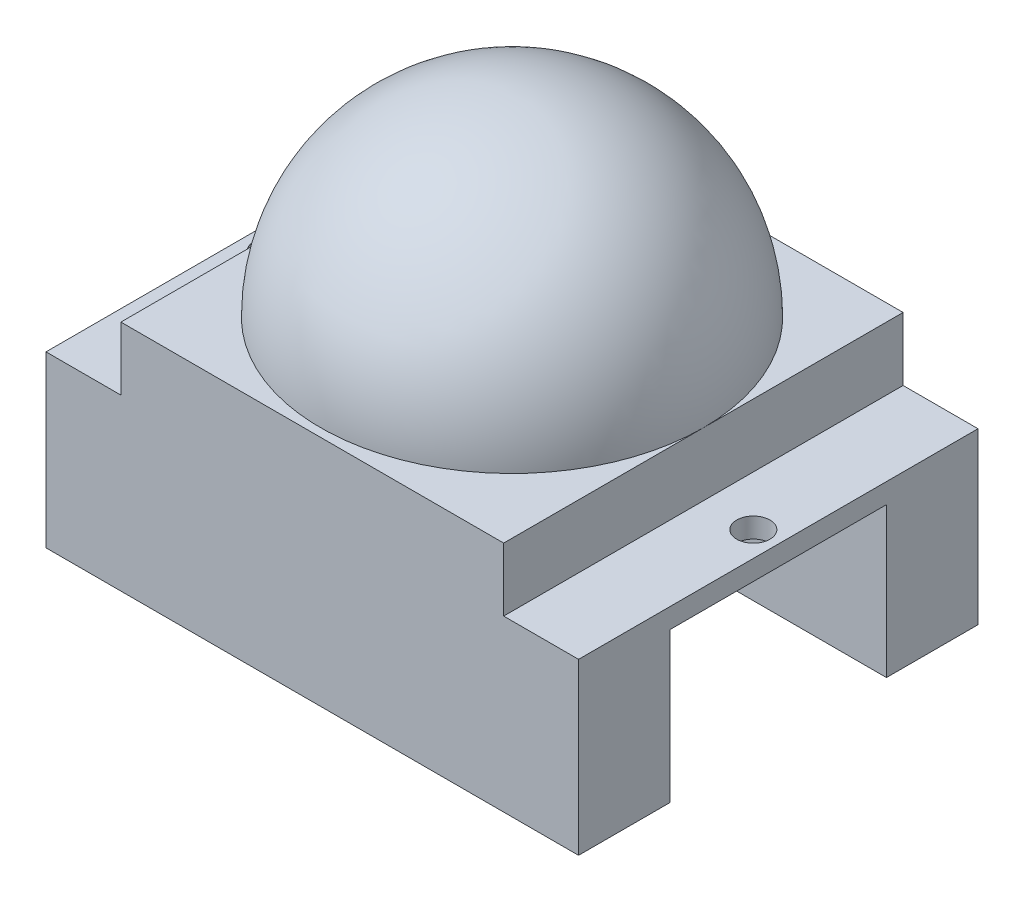
ISO-10303-21;
HEADER;
FILE_DESCRIPTION(('STEP AP214'),'2;1');
FILE_NAME('part.step','',(''),(''),'','','');
FILE_SCHEMA(('AUTOMOTIVE_DESIGN { 1 0 10303 214 1 1 1 1 }'));
ENDSEC;
DATA;
#1=APPLICATION_CONTEXT('core data for automotive mechanical design processes');
#2=APPLICATION_PROTOCOL_DEFINITION('international standard','automotive_design',2000,#1);
#3=PRODUCT_CONTEXT('',#1,'mechanical');
#4=PRODUCT('Part','Part','',(#3));
#5=PRODUCT_RELATED_PRODUCT_CATEGORY('part','',(#4));
#6=PRODUCT_DEFINITION_FORMATION('','',#4);
#7=PRODUCT_DEFINITION_CONTEXT('part definition',#1,'design');
#8=PRODUCT_DEFINITION('design','',#6,#7);
#9=PRODUCT_DEFINITION_SHAPE('','',#8);
#10=(LENGTH_UNIT() NAMED_UNIT(*) SI_UNIT(.MILLI.,.METRE.));
#11=(NAMED_UNIT(*) PLANE_ANGLE_UNIT() SI_UNIT($,.RADIAN.));
#12=(NAMED_UNIT(*) SI_UNIT($,.STERADIAN.) SOLID_ANGLE_UNIT());
#13=UNCERTAINTY_MEASURE_WITH_UNIT(LENGTH_MEASURE(1.E-05),#10,'distance_accuracy_value','');
#14=(GEOMETRIC_REPRESENTATION_CONTEXT(3) GLOBAL_UNCERTAINTY_ASSIGNED_CONTEXT((#13)) GLOBAL_UNIT_ASSIGNED_CONTEXT((#10,
#11,#12)) REPRESENTATION_CONTEXT('',''));
#15=CARTESIAN_POINT('',(0.,0.,0.));
#16=DIRECTION('',(0.,0.,1.));
#17=DIRECTION('',(1.,0.,0.));
#18=AXIS2_PLACEMENT_3D('',#15,#16,#17);
#19=CARTESIAN_POINT('',(0.,5.,0.));
#20=DIRECTION('',(0.,1.,0.));
#21=DIRECTION('',(0.,0.,1.));
#22=AXIS2_PLACEMENT_3D('',#19,#20,#21);
#23=PLANE('',#22);
#24=CARTESIAN_POINT('',(0.,5.,0.));
#25=DIRECTION('',(0.,1.,0.));
#26=DIRECTION('',(0.,0.,1.));
#27=AXIS2_PLACEMENT_3D('',#24,#25,#26);
#28=CIRCLE('',#27,11.5);
#29=CARTESIAN_POINT('',(11.5,5.,0.));
#30=VERTEX_POINT('',#29);
#31=CARTESIAN_POINT('',(-11.5,5.,0.));
#32=VERTEX_POINT('',#31);
#33=EDGE_CURVE('E11',#30,#32,#28,.T.);
#34=ORIENTED_EDGE('',*,*,#33,.F.);
#35=DIRECTION('',(0.,0.,-1.));
#36=VECTOR('',#35,1.);
#37=CARTESIAN_POINT('',(11.5,5.,12.));
#38=LINE('',#37,#36);
#39=CARTESIAN_POINT('',(11.5,5.,-12.));
#40=VERTEX_POINT('',#39);
#41=EDGE_CURVE('E196',#30,#40,#38,.T.);
#42=ORIENTED_EDGE('',*,*,#41,.T.);
#43=DIRECTION('',(-1.,0.,0.));
#44=VECTOR('',#43,1.);
#45=CARTESIAN_POINT('',(11.5,5.,-12.));
#46=LINE('',#45,#44);
#47=CARTESIAN_POINT('',(-11.5,5.,-12.));
#48=VERTEX_POINT('',#47);
#49=EDGE_CURVE('E187',#40,#48,#46,.T.);
#50=ORIENTED_EDGE('',*,*,#49,.T.);
#51=DIRECTION('',(0.,0.,1.));
#52=VECTOR('',#51,1.);
#53=CARTESIAN_POINT('',(-11.5,5.,-12.));
#54=LINE('',#53,#52);
#55=EDGE_CURVE('E191',#48,#32,#54,.T.);
#56=ORIENTED_EDGE('',*,*,#55,.T.);
#57=EDGE_LOOP('',(#34,#42,#50,#56));
#58=FACE_BOUND('',#57,.T.);
#59=ADVANCED_FACE('F38',(#58),#23,.T.);
#60=CARTESIAN_POINT('',(0.,1.2,0.));
#61=DIRECTION('',(0.,-1.,0.));
#62=DIRECTION('',(0.,0.,-1.));
#63=AXIS2_PLACEMENT_3D('',#60,#61,#62);
#64=PLANE('',#63);
#65=CARTESIAN_POINT('',(-14.5,1.2,0.));
#66=DIRECTION('',(0.,-1.,0.));
#67=DIRECTION('',(0.,0.,-1.));
#68=AXIS2_PLACEMENT_3D('',#65,#66,#67);
#69=CIRCLE('',#68,1.);
#70=CARTESIAN_POINT('',(-14.5,1.2,-1.));
#71=VERTEX_POINT('',#70);
#72=EDGE_CURVE('E461',#71,#71,#69,.F.);
#73=ORIENTED_EDGE('',*,*,#72,.F.);
#74=EDGE_LOOP('',(#73));
#75=FACE_BOUND('',#74,.T.);
#76=DIRECTION('',(0.,0.,1.));
#77=VECTOR('',#76,1.);
#78=CARTESIAN_POINT('',(-11.5,1.2,0.));
#79=LINE('',#78,#77);
#80=CARTESIAN_POINT('',(-11.5,1.2,-12.));
#81=VERTEX_POINT('',#80);
#82=CARTESIAN_POINT('',(-11.5,1.2,12.));
#83=VERTEX_POINT('',#82);
#84=EDGE_CURVE('E214',#81,#83,#79,.T.);
#85=ORIENTED_EDGE('',*,*,#84,.F.);
#86=DIRECTION('',(1.,0.,0.));
#87=VECTOR('',#86,1.);
#88=CARTESIAN_POINT('',(-16.,1.2,-12.));
#89=LINE('',#88,#87);
#90=CARTESIAN_POINT('',(-16.,1.2,-12.));
#91=VERTEX_POINT('',#90);
#92=EDGE_CURVE('E225',#91,#81,#89,.T.);
#93=ORIENTED_EDGE('',*,*,#92,.F.);
#94=DIRECTION('',(0.,0.,1.));
#95=VECTOR('',#94,1.);
#96=CARTESIAN_POINT('',(-16.,1.2,-12.));
#97=LINE('',#96,#95);
#98=CARTESIAN_POINT('',(-16.,1.2,12.));
#99=VERTEX_POINT('',#98);
#100=EDGE_CURVE('E228',#91,#99,#97,.T.);
#101=ORIENTED_EDGE('',*,*,#100,.T.);
#102=DIRECTION('',(1.,0.,0.));
#103=VECTOR('',#102,1.);
#104=CARTESIAN_POINT('',(-16.,1.2,12.));
#105=LINE('',#104,#103);
#106=EDGE_CURVE('E218',#99,#83,#105,.T.);
#107=ORIENTED_EDGE('',*,*,#106,.T.);
#108=EDGE_LOOP('',(#85,#93,#101,#107));
#109=FACE_BOUND('',#108,.T.);
#110=ADVANCED_FACE('F248',(#75,#109),#64,.F.);
#111=CARTESIAN_POINT('',(14.5,1.2,0.));
#112=DIRECTION('',(0.,-1.,0.));
#113=DIRECTION('',(0.,0.,-1.));
#114=AXIS2_PLACEMENT_3D('',#111,#112,#113);
#115=CIRCLE('',#114,1.);
#116=CARTESIAN_POINT('',(14.5,1.2,-1.));
#117=VERTEX_POINT('',#116);
#118=EDGE_CURVE('E161',#117,#117,#115,.F.);
#119=ORIENTED_EDGE('',*,*,#118,.F.);
#120=EDGE_LOOP('',(#119));
#121=FACE_BOUND('',#120,.T.);
#122=DIRECTION('',(0.,0.,-1.));
#123=VECTOR('',#122,1.);
#124=CARTESIAN_POINT('',(11.5,1.2,0.));
#125=LINE('',#124,#123);
#126=CARTESIAN_POINT('',(11.5,1.2,12.));
#127=VERTEX_POINT('',#126);
#128=CARTESIAN_POINT('',(11.5,1.2,-12.));
#129=VERTEX_POINT('',#128);
#130=EDGE_CURVE('E211',#127,#129,#125,.T.);
#131=ORIENTED_EDGE('',*,*,#130,.F.);
#132=CARTESIAN_POINT('',(16.,1.2,12.));
#133=VERTEX_POINT('',#132);
#134=EDGE_CURVE('E221',#127,#133,#105,.T.);
#135=ORIENTED_EDGE('',*,*,#134,.T.);
#136=DIRECTION('',(0.,0.,1.));
#137=VECTOR('',#136,1.);
#138=CARTESIAN_POINT('',(16.,1.2,-12.));
#139=LINE('',#138,#137);
#140=CARTESIAN_POINT('',(16.,1.2,-12.));
#141=VERTEX_POINT('',#140);
#142=EDGE_CURVE('E220',#141,#133,#139,.T.);
#143=ORIENTED_EDGE('',*,*,#142,.F.);
#144=EDGE_CURVE('E224',#129,#141,#89,.T.);
#145=ORIENTED_EDGE('',*,*,#144,.F.);
#146=EDGE_LOOP('',(#131,#135,#143,#145));
#147=FACE_BOUND('',#146,.T.);
#148=ADVANCED_FACE('F266',(#121,#147),#64,.F.);
#149=CARTESIAN_POINT('',(-16.,1.2,12.));
#150=DIRECTION('',(0.,0.,-1.));
#151=DIRECTION('',(-1.,0.,0.));
#152=AXIS2_PLACEMENT_3D('',#149,#150,#151);
#153=PLANE('',#152);
#154=DIRECTION('',(0.,-1.,0.));
#155=VECTOR('',#154,1.);
#156=CARTESIAN_POINT('',(-16.,1.2,12.));
#157=LINE('',#156,#155);
#158=CARTESIAN_POINT('',(-16.,-9.,12.));
#159=VERTEX_POINT('',#158);
#160=EDGE_CURVE('E230',#99,#159,#157,.T.);
#161=ORIENTED_EDGE('',*,*,#160,.T.);
#162=DIRECTION('',(1.,0.,0.));
#163=VECTOR('',#162,1.);
#164=CARTESIAN_POINT('',(0.,-9.,12.));
#165=LINE('',#164,#163);
#166=CARTESIAN_POINT('',(16.,-9.,12.));
#167=VERTEX_POINT('',#166);
#168=EDGE_CURVE('E156',#159,#167,#165,.T.);
#169=ORIENTED_EDGE('',*,*,#168,.T.);
#170=DIRECTION('',(0.,-1.,0.));
#171=VECTOR('',#170,1.);
#172=CARTESIAN_POINT('',(16.,1.2,12.));
#173=LINE('',#172,#171);
#174=EDGE_CURVE('E46',#133,#167,#173,.T.);
#175=ORIENTED_EDGE('',*,*,#174,.F.);
#176=ORIENTED_EDGE('',*,*,#134,.F.);
#177=DIRECTION('',(0.,-1.,0.));
#178=VECTOR('',#177,1.);
#179=CARTESIAN_POINT('',(11.5,5.,12.));
#180=LINE('',#179,#178);
#181=CARTESIAN_POINT('',(11.5,5.,12.));
#182=VERTEX_POINT('',#181);
#183=EDGE_CURVE('E202',#182,#127,#180,.T.);
#184=ORIENTED_EDGE('',*,*,#183,.F.);
#185=DIRECTION('',(1.,0.,0.));
#186=VECTOR('',#185,1.);
#187=CARTESIAN_POINT('',(-11.5,5.,12.));
#188=LINE('',#187,#186);
#189=CARTESIAN_POINT('',(-11.5,5.,12.));
#190=VERTEX_POINT('',#189);
#191=EDGE_CURVE('E194',#190,#182,#188,.T.);
#192=ORIENTED_EDGE('',*,*,#191,.F.);
#193=DIRECTION('',(0.,-1.,0.));
#194=VECTOR('',#193,1.);
#195=CARTESIAN_POINT('',(-11.5,5.,12.));
#196=LINE('',#195,#194);
#197=EDGE_CURVE('E205',#190,#83,#196,.T.);
#198=ORIENTED_EDGE('',*,*,#197,.T.);
#199=ORIENTED_EDGE('',*,*,#106,.F.);
#200=EDGE_LOOP('',(#161,#169,#175,#176,#184,#192,#198,#199));
#201=FACE_BOUND('',#200,.T.);
#202=ADVANCED_FACE('F40',(#201),#153,.F.);
#203=CARTESIAN_POINT('',(16.,1.2,-12.));
#204=DIRECTION('',(1.,0.,0.));
#205=DIRECTION('',(0.,0.,-1.));
#206=AXIS2_PLACEMENT_3D('',#203,#204,#205);
#207=PLANE('',#206);
#208=DIRECTION('',(0.,0.,1.));
#209=VECTOR('',#208,1.);
#210=CARTESIAN_POINT('',(16.,0.,-12.));
#211=LINE('',#210,#209);
#212=CARTESIAN_POINT('',(16.,0.,-6.5));
#213=VERTEX_POINT('',#212);
#214=CARTESIAN_POINT('',(16.,0.,6.5));
#215=VERTEX_POINT('',#214);
#216=EDGE_CURVE('E217',#213,#215,#211,.T.);
#217=ORIENTED_EDGE('',*,*,#216,.F.);
#218=DIRECTION('',(0.,1.,0.));
#219=VECTOR('',#218,1.);
#220=CARTESIAN_POINT('',(16.,-9.,-6.5));
#221=LINE('',#220,#219);
#222=CARTESIAN_POINT('',(16.,-9.,-6.5));
#223=VERTEX_POINT('',#222);
#224=EDGE_CURVE('E180',#223,#213,#221,.T.);
#225=ORIENTED_EDGE('',*,*,#224,.F.);
#226=DIRECTION('',(0.,0.,1.));
#227=VECTOR('',#226,1.);
#228=CARTESIAN_POINT('',(16.,-9.,0.));
#229=LINE('',#228,#227);
#230=CARTESIAN_POINT('',(16.,-9.,-12.));
#231=VERTEX_POINT('',#230);
#232=EDGE_CURVE('E172',#231,#223,#229,.T.);
#233=ORIENTED_EDGE('',*,*,#232,.F.);
#234=DIRECTION('',(0.,-1.,0.));
#235=VECTOR('',#234,1.);
#236=CARTESIAN_POINT('',(16.,1.2,-12.));
#237=LINE('',#236,#235);
#238=EDGE_CURVE('E236',#141,#231,#237,.T.);
#239=ORIENTED_EDGE('',*,*,#238,.F.);
#240=ORIENTED_EDGE('',*,*,#142,.T.);
#241=ORIENTED_EDGE('',*,*,#174,.T.);
#242=DIRECTION('',(0.,0.,-1.));
#243=VECTOR('',#242,1.);
#244=CARTESIAN_POINT('',(16.,-9.,0.));
#245=LINE('',#244,#243);
#246=CARTESIAN_POINT('',(16.,-9.,6.5));
#247=VERTEX_POINT('',#246);
#248=EDGE_CURVE('E146',#167,#247,#245,.T.);
#249=ORIENTED_EDGE('',*,*,#248,.T.);
#250=DIRECTION('',(0.,1.,0.));
#251=VECTOR('',#250,1.);
#252=CARTESIAN_POINT('',(16.,-9.,6.5));
#253=LINE('',#252,#251);
#254=EDGE_CURVE('E145',#247,#215,#253,.T.);
#255=ORIENTED_EDGE('',*,*,#254,.T.);
#256=EDGE_LOOP('',(#217,#225,#233,#239,#240,#241,#249,#255));
#257=FACE_BOUND('',#256,.T.);
#258=ADVANCED_FACE('F239',(#257),#207,.T.);
#259=CARTESIAN_POINT('',(-16.,1.2,-12.));
#260=DIRECTION('',(0.,0.,-1.));
#261=DIRECTION('',(-1.,0.,0.));
#262=AXIS2_PLACEMENT_3D('',#259,#260,#261);
#263=PLANE('',#262);
#264=ORIENTED_EDGE('',*,*,#238,.T.);
#265=DIRECTION('',(1.,0.,0.));
#266=VECTOR('',#265,1.);
#267=CARTESIAN_POINT('',(0.,-9.,-12.));
#268=LINE('',#267,#266);
#269=CARTESIAN_POINT('',(-16.,-9.,-12.));
#270=VERTEX_POINT('',#269);
#271=EDGE_CURVE('E174',#270,#231,#268,.T.);
#272=ORIENTED_EDGE('',*,*,#271,.F.);
#273=DIRECTION('',(0.,-1.,0.));
#274=VECTOR('',#273,1.);
#275=CARTESIAN_POINT('',(-16.,1.2,-12.));
#276=LINE('',#275,#274);
#277=EDGE_CURVE('E234',#91,#270,#276,.T.);
#278=ORIENTED_EDGE('',*,*,#277,.F.);
#279=ORIENTED_EDGE('',*,*,#92,.T.);
#280=DIRECTION('',(0.,-1.,0.));
#281=VECTOR('',#280,1.);
#282=CARTESIAN_POINT('',(-11.5,5.,-12.));
#283=LINE('',#282,#281);
#284=EDGE_CURVE('E208',#48,#81,#283,.T.);
#285=ORIENTED_EDGE('',*,*,#284,.F.);
#286=ORIENTED_EDGE('',*,*,#49,.F.);
#287=DIRECTION('',(0.,-1.,0.));
#288=VECTOR('',#287,1.);
#289=CARTESIAN_POINT('',(11.5,5.,-12.));
#290=LINE('',#289,#288);
#291=EDGE_CURVE('E199',#40,#129,#290,.T.);
#292=ORIENTED_EDGE('',*,*,#291,.T.);
#293=ORIENTED_EDGE('',*,*,#144,.T.);
#294=EDGE_LOOP('',(#264,#272,#278,#279,#285,#286,#292,#293));
#295=FACE_BOUND('',#294,.T.);
#296=ADVANCED_FACE('F251',(#295),#263,.T.);
#297=CARTESIAN_POINT('',(-16.,1.2,-12.));
#298=DIRECTION('',(1.,0.,0.));
#299=DIRECTION('',(0.,0.,-1.));
#300=AXIS2_PLACEMENT_3D('',#297,#298,#299);
#301=PLANE('',#300);
#302=ORIENTED_EDGE('',*,*,#277,.T.);
#303=DIRECTION('',(0.,0.,-1.));
#304=VECTOR('',#303,1.);
#305=CARTESIAN_POINT('',(-16.,-9.,0.));
#306=LINE('',#305,#304);
#307=CARTESIAN_POINT('',(-16.,-9.,-6.5));
#308=VERTEX_POINT('',#307);
#309=EDGE_CURVE('E177',#308,#270,#306,.T.);
#310=ORIENTED_EDGE('',*,*,#309,.F.);
#311=DIRECTION('',(0.,1.,0.));
#312=VECTOR('',#311,1.);
#313=CARTESIAN_POINT('',(-16.,-9.,-6.5));
#314=LINE('',#313,#312);
#315=CARTESIAN_POINT('',(-16.,0.,-6.5));
#316=VERTEX_POINT('',#315);
#317=EDGE_CURVE('E182',#308,#316,#314,.T.);
#318=ORIENTED_EDGE('',*,*,#317,.T.);
#319=DIRECTION('',(0.,0.,1.));
#320=VECTOR('',#319,1.);
#321=CARTESIAN_POINT('',(-16.,0.,-12.));
#322=LINE('',#321,#320);
#323=CARTESIAN_POINT('',(-16.,0.,6.5));
#324=VERTEX_POINT('',#323);
#325=EDGE_CURVE('E140',#316,#324,#322,.T.);
#326=ORIENTED_EDGE('',*,*,#325,.T.);
#327=DIRECTION('',(0.,1.,0.));
#328=VECTOR('',#327,1.);
#329=CARTESIAN_POINT('',(-16.,-9.,6.5));
#330=LINE('',#329,#328);
#331=CARTESIAN_POINT('',(-16.,-9.,6.5));
#332=VERTEX_POINT('',#331);
#333=EDGE_CURVE('E134',#332,#324,#330,.T.);
#334=ORIENTED_EDGE('',*,*,#333,.F.);
#335=DIRECTION('',(0.,0.,1.));
#336=VECTOR('',#335,1.);
#337=CARTESIAN_POINT('',(-16.,-9.,0.));
#338=LINE('',#337,#336);
#339=EDGE_CURVE('E138',#332,#159,#338,.T.);
#340=ORIENTED_EDGE('',*,*,#339,.T.);
#341=ORIENTED_EDGE('',*,*,#160,.F.);
#342=ORIENTED_EDGE('',*,*,#100,.F.);
#343=EDGE_LOOP('',(#302,#310,#318,#326,#334,#340,#341,#342));
#344=FACE_BOUND('',#343,.T.);
#345=ADVANCED_FACE('F136',(#344),#301,.F.);
#346=CARTESIAN_POINT('',(0.,0.,0.));
#347=DIRECTION('',(0.,-1.,0.));
#348=DIRECTION('',(0.,0.,-1.));
#349=AXIS2_PLACEMENT_3D('',#346,#347,#348);
#350=PLANE('',#349);
#351=CARTESIAN_POINT('',(14.5,0.,0.));
#352=DIRECTION('',(0.,1.,0.));
#353=DIRECTION('',(0.,0.,1.));
#354=AXIS2_PLACEMENT_3D('',#351,#352,#353);
#355=CIRCLE('',#354,1.);
#356=CARTESIAN_POINT('',(14.5,0.,1.));
#357=VERTEX_POINT('',#356);
#358=EDGE_CURVE('E458',#357,#357,#355,.T.);
#359=ORIENTED_EDGE('',*,*,#358,.T.);
#360=EDGE_LOOP('',(#359));
#361=FACE_BOUND('',#360,.T.);
#362=CARTESIAN_POINT('',(-14.5,0.,0.));
#363=DIRECTION('',(0.,1.,0.));
#364=DIRECTION('',(0.,0.,1.));
#365=AXIS2_PLACEMENT_3D('',#362,#363,#364);
#366=CIRCLE('',#365,1.);
#367=CARTESIAN_POINT('',(-14.5,0.,1.));
#368=VERTEX_POINT('',#367);
#369=EDGE_CURVE('E464',#368,#368,#366,.T.);
#370=ORIENTED_EDGE('',*,*,#369,.T.);
#371=EDGE_LOOP('',(#370));
#372=FACE_BOUND('',#371,.T.);
#373=DIRECTION('',(-1.,0.,0.));
#374=VECTOR('',#373,1.);
#375=CARTESIAN_POINT('',(0.,0.,6.5));
#376=LINE('',#375,#374);
#377=EDGE_CURVE('E159',#215,#324,#376,.T.);
#378=ORIENTED_EDGE('',*,*,#377,.T.);
#379=ORIENTED_EDGE('',*,*,#325,.F.);
#380=DIRECTION('',(-1.,0.,0.));
#381=VECTOR('',#380,1.);
#382=CARTESIAN_POINT('',(0.,0.,-6.5));
#383=LINE('',#382,#381);
#384=EDGE_CURVE('E53',#213,#316,#383,.T.);
#385=ORIENTED_EDGE('',*,*,#384,.F.);
#386=ORIENTED_EDGE('',*,*,#216,.T.);
#387=EDGE_LOOP('',(#378,#379,#385,#386));
#388=FACE_BOUND('',#387,.T.);
#389=ADVANCED_FACE('F293',(#361,#372,#388),#350,.T.);
#390=CARTESIAN_POINT('',(-11.5,5.,-12.));
#391=DIRECTION('',(1.,0.,0.));
#392=DIRECTION('',(0.,0.,-1.));
#393=AXIS2_PLACEMENT_3D('',#390,#391,#392);
#394=PLANE('',#393);
#395=ORIENTED_EDGE('',*,*,#284,.T.);
#396=ORIENTED_EDGE('',*,*,#84,.T.);
#397=ORIENTED_EDGE('',*,*,#197,.F.);
#398=EDGE_CURVE('E190',#32,#190,#54,.T.);
#399=ORIENTED_EDGE('',*,*,#398,.F.);
#400=ORIENTED_EDGE('',*,*,#55,.F.);
#401=EDGE_LOOP('',(#395,#396,#397,#399,#400));
#402=FACE_BOUND('',#401,.T.);
#403=ADVANCED_FACE('F255',(#402),#394,.F.);
#404=CARTESIAN_POINT('',(11.5,5.,12.));
#405=DIRECTION('',(-1.,0.,0.));
#406=DIRECTION('',(0.,0.,1.));
#407=AXIS2_PLACEMENT_3D('',#404,#405,#406);
#408=PLANE('',#407);
#409=ORIENTED_EDGE('',*,*,#183,.T.);
#410=ORIENTED_EDGE('',*,*,#130,.T.);
#411=ORIENTED_EDGE('',*,*,#291,.F.);
#412=ORIENTED_EDGE('',*,*,#41,.F.);
#413=EDGE_CURVE('E197',#182,#30,#38,.T.);
#414=ORIENTED_EDGE('',*,*,#413,.F.);
#415=EDGE_LOOP('',(#409,#410,#411,#412,#414));
#416=FACE_BOUND('',#415,.T.);
#417=ADVANCED_FACE('F262',(#416),#408,.F.);
#418=CARTESIAN_POINT('',(0.,5.,0.));
#419=DIRECTION('',(0.,-1.,0.));
#420=DIRECTION('',(1.,0.,0.));
#421=AXIS2_PLACEMENT_3D('',#418,#419,#420);
#422=CIRCLE('',#421,11.5);
#423=EDGE_CURVE('E61',#30,#32,#422,.T.);
#424=ORIENTED_EDGE('',*,*,#423,.T.);
#425=ORIENTED_EDGE('',*,*,#398,.T.);
#426=ORIENTED_EDGE('',*,*,#191,.T.);
#427=ORIENTED_EDGE('',*,*,#413,.T.);
#428=EDGE_LOOP('',(#424,#425,#426,#427));
#429=FACE_BOUND('',#428,.T.);
#430=ADVANCED_FACE('F268',(#429),#23,.T.);
#431=CARTESIAN_POINT('',(0.,5.,0.));
#432=DIRECTION('',(0.,-1.,0.));
#433=DIRECTION('',(1.,0.,0.));
#434=AXIS2_PLACEMENT_3D('',#431,#432,#433);
#435=SPHERICAL_SURFACE('',#434,11.5);
#436=ORIENTED_EDGE('',*,*,#423,.F.);
#437=ORIENTED_EDGE('',*,*,#33,.T.);
#438=EDGE_LOOP('',(#436,#437));
#439=FACE_BOUND('',#438,.T.);
#440=ADVANCED_FACE('F270',(#439),#435,.T.);
#441=CARTESIAN_POINT('',(0.,-9.,-6.5));
#442=DIRECTION('',(0.,0.,-1.));
#443=DIRECTION('',(-1.,0.,0.));
#444=AXIS2_PLACEMENT_3D('',#441,#442,#443);
#445=PLANE('',#444);
#446=ORIENTED_EDGE('',*,*,#384,.T.);
#447=ORIENTED_EDGE('',*,*,#317,.F.);
#448=DIRECTION('',(-1.,0.,0.));
#449=VECTOR('',#448,1.);
#450=CARTESIAN_POINT('',(0.,-9.,-6.5));
#451=LINE('',#450,#449);
#452=EDGE_CURVE('E169',#223,#308,#451,.T.);
#453=ORIENTED_EDGE('',*,*,#452,.F.);
#454=ORIENTED_EDGE('',*,*,#224,.T.);
#455=EDGE_LOOP('',(#446,#447,#453,#454));
#456=FACE_BOUND('',#455,.T.);
#457=ADVANCED_FACE('F276',(#456),#445,.F.);
#458=CARTESIAN_POINT('',(0.,-9.,0.));
#459=DIRECTION('',(0.,1.,0.));
#460=DIRECTION('',(0.,0.,1.));
#461=AXIS2_PLACEMENT_3D('',#458,#459,#460);
#462=PLANE('',#461);
#463=ORIENTED_EDGE('',*,*,#452,.T.);
#464=ORIENTED_EDGE('',*,*,#309,.T.);
#465=ORIENTED_EDGE('',*,*,#271,.T.);
#466=ORIENTED_EDGE('',*,*,#232,.T.);
#467=EDGE_LOOP('',(#463,#464,#465,#466));
#468=FACE_BOUND('',#467,.T.);
#469=ADVANCED_FACE('F354',(#468),#462,.F.);
#470=CARTESIAN_POINT('',(0.,-9.,6.5));
#471=DIRECTION('',(0.,0.,-1.));
#472=DIRECTION('',(-1.,0.,0.));
#473=AXIS2_PLACEMENT_3D('',#470,#471,#472);
#474=PLANE('',#473);
#475=ORIENTED_EDGE('',*,*,#377,.F.);
#476=ORIENTED_EDGE('',*,*,#254,.F.);
#477=DIRECTION('',(-1.,0.,0.));
#478=VECTOR('',#477,1.);
#479=CARTESIAN_POINT('',(0.,-9.,6.5));
#480=LINE('',#479,#478);
#481=EDGE_CURVE('E153',#247,#332,#480,.T.);
#482=ORIENTED_EDGE('',*,*,#481,.T.);
#483=ORIENTED_EDGE('',*,*,#333,.T.);
#484=EDGE_LOOP('',(#475,#476,#482,#483));
#485=FACE_BOUND('',#484,.T.);
#486=ADVANCED_FACE('F158',(#485),#474,.T.);
#487=CARTESIAN_POINT('',(0.,-9.,0.));
#488=DIRECTION('',(0.,1.,0.));
#489=DIRECTION('',(0.,0.,1.));
#490=AXIS2_PLACEMENT_3D('',#487,#488,#489);
#491=PLANE('',#490);
#492=ORIENTED_EDGE('',*,*,#481,.F.);
#493=ORIENTED_EDGE('',*,*,#248,.F.);
#494=ORIENTED_EDGE('',*,*,#168,.F.);
#495=ORIENTED_EDGE('',*,*,#339,.F.);
#496=EDGE_LOOP('',(#492,#493,#494,#495));
#497=FACE_BOUND('',#496,.T.);
#498=ADVANCED_FACE('F151',(#497),#491,.F.);
#499=CARTESIAN_POINT('',(-14.5,10.,0.));
#500=DIRECTION('',(0.,-1.,0.));
#501=DIRECTION('',(0.,0.,-1.));
#502=AXIS2_PLACEMENT_3D('',#499,#500,#501);
#503=CYLINDRICAL_SURFACE('',#502,1.);
#504=ORIENTED_EDGE('',*,*,#369,.F.);
#505=EDGE_LOOP('',(#504));
#506=FACE_BOUND('',#505,.T.);
#507=ORIENTED_EDGE('',*,*,#72,.T.);
#508=EDGE_LOOP('',(#507));
#509=FACE_BOUND('',#508,.T.);
#510=ADVANCED_FACE('F327',(#506,#509),#503,.F.);
#511=CARTESIAN_POINT('',(14.5,10.,0.));
#512=DIRECTION('',(0.,-1.,0.));
#513=DIRECTION('',(0.,0.,-1.));
#514=AXIS2_PLACEMENT_3D('',#511,#512,#513);
#515=CYLINDRICAL_SURFACE('',#514,1.);
#516=ORIENTED_EDGE('',*,*,#358,.F.);
#517=EDGE_LOOP('',(#516));
#518=FACE_BOUND('',#517,.T.);
#519=ORIENTED_EDGE('',*,*,#118,.T.);
#520=EDGE_LOOP('',(#519));
#521=FACE_BOUND('',#520,.T.);
#522=ADVANCED_FACE('F332',(#518,#521),#515,.F.);
#523=CLOSED_SHELL('',(#59,#110,#148,#202,#258,#296,#345,#389,#403,#417,#430,#440,#457,#469,#486,
#498,#510,#522));
#524=MANIFOLD_SOLID_BREP('B2',#523);
#525=ADVANCED_BREP_SHAPE_REPRESENTATION('',(#18,#524),#14);
#526=SHAPE_DEFINITION_REPRESENTATION(#9,#525);
ENDSEC;
END-ISO-10303-21;
